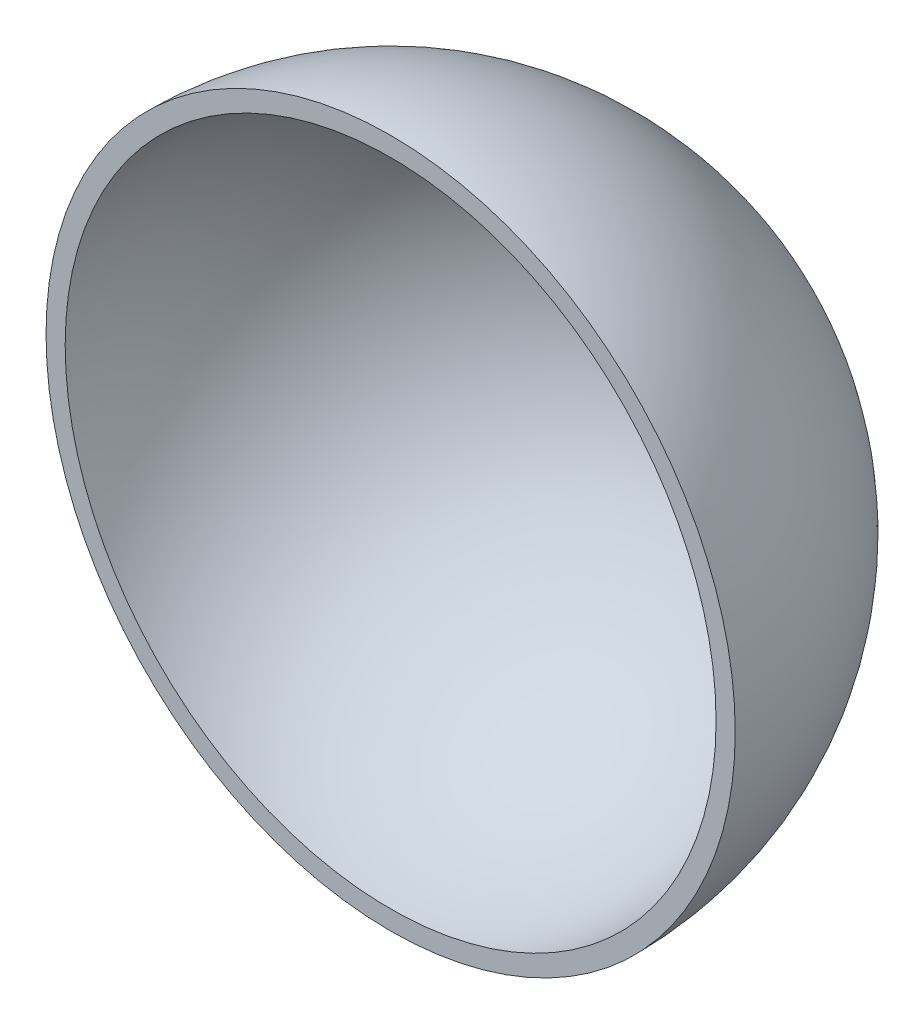
ISO-10303-21;
HEADER;
FILE_DESCRIPTION(('STEP AP214'),'2;1');
FILE_NAME('part.step','',(''),(''),'','','');
FILE_SCHEMA(('AUTOMOTIVE_DESIGN { 1 0 10303 214 1 1 1 1 }'));
ENDSEC;
DATA;
#1=APPLICATION_CONTEXT('core data for automotive mechanical design processes');
#2=APPLICATION_PROTOCOL_DEFINITION('international standard','automotive_design',2000,#1);
#3=PRODUCT_CONTEXT('',#1,'mechanical');
#4=PRODUCT('Part','Part','',(#3));
#5=PRODUCT_RELATED_PRODUCT_CATEGORY('part','',(#4));
#6=PRODUCT_DEFINITION_FORMATION('','',#4);
#7=PRODUCT_DEFINITION_CONTEXT('part definition',#1,'design');
#8=PRODUCT_DEFINITION('design','',#6,#7);
#9=PRODUCT_DEFINITION_SHAPE('','',#8);
#10=(LENGTH_UNIT() NAMED_UNIT(*) SI_UNIT(.MILLI.,.METRE.));
#11=(NAMED_UNIT(*) PLANE_ANGLE_UNIT() SI_UNIT($,.RADIAN.));
#12=(NAMED_UNIT(*) SI_UNIT($,.STERADIAN.) SOLID_ANGLE_UNIT());
#13=UNCERTAINTY_MEASURE_WITH_UNIT(LENGTH_MEASURE(1.E-05),#10,'distance_accuracy_value','');
#14=(GEOMETRIC_REPRESENTATION_CONTEXT(3) GLOBAL_UNCERTAINTY_ASSIGNED_CONTEXT((#13)) GLOBAL_UNIT_ASSIGNED_CONTEXT((#10,
#11,#12)) REPRESENTATION_CONTEXT('',''));
#15=CARTESIAN_POINT('',(0.,0.,0.));
#16=DIRECTION('',(0.,0.,1.));
#17=DIRECTION('',(1.,0.,0.));
#18=AXIS2_PLACEMENT_3D('',#15,#16,#17);
#19=CARTESIAN_POINT('',(0.,90.,0.));
#20=DIRECTION('',(0.,-1.,0.));
#21=DIRECTION('',(1.,0.,0.));
#22=AXIS2_PLACEMENT_3D('',#19,#20,#21);
#23=SPHERICAL_SURFACE('',#22,85.);
#24=CARTESIAN_POINT('',(0.,90.,0.));
#25=DIRECTION('',(0.,0.,1.));
#26=DIRECTION('',(1.,0.,0.));
#27=AXIS2_PLACEMENT_3D('',#24,#25,#26);
#28=SPHERICAL_SURFACE('',#27,85.);
#29=CARTESIAN_POINT('',(0.,90.,-84.9632273398321));
#30=DIRECTION('',(0.,0.,1.));
#31=DIRECTION('',(1.,0.,0.));
#32=AXIS2_PLACEMENT_3D('',#29,#30,#31);
#33=CIRCLE('',#32,2.5);
#34=CARTESIAN_POINT('',(2.5,90.,-84.9632273398321));
#35=VERTEX_POINT('',#34);
#36=EDGE_CURVE('E51',#35,#35,#33,.T.);
#37=ORIENTED_EDGE('',*,*,#36,.F.);
#38=EDGE_LOOP('',(#37));
#39=FACE_BOUND('',#38,.T.);
#40=CARTESIAN_POINT('',(0.,90.,0.));
#41=DIRECTION('',(0.,0.,-1.));
#42=DIRECTION('',(-1.,0.,0.));
#43=AXIS2_PLACEMENT_3D('',#40,#41,#42);
#44=CIRCLE('',#43,85.);
#45=CARTESIAN_POINT('',(-85.,90.,5.93551827603333E-13));
#46=VERTEX_POINT('',#45);
#47=EDGE_CURVE('E46',#46,#46,#44,.F.);
#48=ORIENTED_EDGE('',*,*,#47,.T.);
#49=EDGE_LOOP('',(#48));
#50=FACE_BOUND('',#49,.T.);
#51=ADVANCED_FACE('F39',(#39,#50),#28,.F.);
#52=CARTESIAN_POINT('',(0.,90.,0.));
#53=DIRECTION('',(0.,-1.,0.));
#54=DIRECTION('',(1.,0.,0.));
#55=AXIS2_PLACEMENT_3D('',#52,#53,#54);
#56=SPHERICAL_SURFACE('',#55,90.);
#57=CARTESIAN_POINT('',(0.,90.,0.));
#58=DIRECTION('',(0.,0.,1.));
#59=DIRECTION('',(1.,0.,0.));
#60=AXIS2_PLACEMENT_3D('',#57,#58,#59);
#61=SPHERICAL_SURFACE('',#60,90.);
#62=CARTESIAN_POINT('',(0.,90.,-89.9652710772329));
#63=DIRECTION('',(0.,0.,1.));
#64=DIRECTION('',(1.,0.,0.));
#65=AXIS2_PLACEMENT_3D('',#62,#63,#64);
#66=CIRCLE('',#65,2.5);
#67=CARTESIAN_POINT('',(2.5,90.,-89.9652710772329));
#68=VERTEX_POINT('',#67);
#69=EDGE_CURVE('E56',#68,#68,#66,.F.);
#70=ORIENTED_EDGE('',*,*,#69,.F.);
#71=EDGE_LOOP('',(#70));
#72=FACE_BOUND('',#71,.T.);
#73=CARTESIAN_POINT('',(0.,90.,0.));
#74=DIRECTION('',(0.,0.,-1.));
#75=DIRECTION('',(-1.,0.,0.));
#76=AXIS2_PLACEMENT_3D('',#73,#74,#75);
#77=CIRCLE('',#76,90.);
#78=CARTESIAN_POINT('',(-90.,90.,6.28466640991764E-13));
#79=VERTEX_POINT('',#78);
#80=EDGE_CURVE('E10',#79,#79,#77,.F.);
#81=ORIENTED_EDGE('',*,*,#80,.F.);
#82=EDGE_LOOP('',(#81));
#83=FACE_BOUND('',#82,.T.);
#84=ADVANCED_FACE('F65',(#72,#83),#61,.T.);
#85=CARTESIAN_POINT('',(0.,0.,0.));
#86=DIRECTION('',(0.,0.,-1.));
#87=DIRECTION('',(-1.,0.,0.));
#88=AXIS2_PLACEMENT_3D('',#85,#86,#87);
#89=PLANE('',#88);
#90=ORIENTED_EDGE('',*,*,#80,.T.);
#91=EDGE_LOOP('',(#90));
#92=FACE_BOUND('',#91,.T.);
#93=ORIENTED_EDGE('',*,*,#47,.F.);
#94=EDGE_LOOP('',(#93));
#95=FACE_BOUND('',#94,.T.);
#96=ADVANCED_FACE('F68',(#92,#95),#89,.F.);
#97=CARTESIAN_POINT('',(0.,90.,-90.001));
#98=DIRECTION('',(0.,0.,1.));
#99=DIRECTION('',(1.,0.,0.));
#100=AXIS2_PLACEMENT_3D('',#97,#98,#99);
#101=CYLINDRICAL_SURFACE('',#100,2.5);
#102=CARTESIAN_POINT('',(2.5,90.,-84.9632273398321));
#103=CARTESIAN_POINT('',(2.5,90.,-85.0153319620968));
#104=CARTESIAN_POINT('',(2.5,90.,-85.0674365843613));
#105=CARTESIAN_POINT('',(2.5,90.,-85.1716458288905));
#106=CARTESIAN_POINT('',(2.5,90.,-85.2237504511551));
#107=CARTESIAN_POINT('',(2.5,90.,-85.3279596956843));
#108=CARTESIAN_POINT('',(2.5,90.,-85.3800643179489));
#109=CARTESIAN_POINT('',(2.5,90.,-85.4842735624781));
#110=CARTESIAN_POINT('',(2.5,90.,-85.5363781847427));
#111=CARTESIAN_POINT('',(2.5,90.,-85.6405874292718));
#112=CARTESIAN_POINT('',(2.5,90.,-85.6926920515364));
#113=CARTESIAN_POINT('',(2.5,90.,-85.7969012960656));
#114=CARTESIAN_POINT('',(2.5,90.,-85.8490059183302));
#115=CARTESIAN_POINT('',(2.5,90.,-85.9532151628594));
#116=CARTESIAN_POINT('',(2.5,90.,-86.005319785124));
#117=CARTESIAN_POINT('',(2.5,90.,-86.1095290296532));
#118=CARTESIAN_POINT('',(2.5,90.,-86.1616336519178));
#119=CARTESIAN_POINT('',(2.5,90.,-86.2658428964469));
#120=CARTESIAN_POINT('',(2.5,90.,-86.3179475187115));
#121=CARTESIAN_POINT('',(2.5,90.,-86.4221567632407));
#122=CARTESIAN_POINT('',(2.5,90.,-86.4742613855053));
#123=CARTESIAN_POINT('',(2.5,90.,-86.5784706300345));
#124=CARTESIAN_POINT('',(2.5,90.,-86.6305752522991));
#125=CARTESIAN_POINT('',(2.5,90.,-86.7347844968283));
#126=CARTESIAN_POINT('',(2.5,90.,-86.7868891190928));
#127=CARTESIAN_POINT('',(2.5,90.,-86.891098363622));
#128=CARTESIAN_POINT('',(2.5,90.,-86.9432029858866));
#129=CARTESIAN_POINT('',(2.5,90.,-87.0474122304158));
#130=CARTESIAN_POINT('',(2.5,90.,-87.0995168526804));
#131=CARTESIAN_POINT('',(2.5,90.,-87.2037260972096));
#132=CARTESIAN_POINT('',(2.5,90.,-87.2558307194742));
#133=CARTESIAN_POINT('',(2.5,90.,-87.3600399640034));
#134=CARTESIAN_POINT('',(2.5,90.,-87.4121445862679));
#135=CARTESIAN_POINT('',(2.5,90.,-87.5163538307971));
#136=CARTESIAN_POINT('',(2.5,90.,-87.5684584530617));
#137=CARTESIAN_POINT('',(2.5,90.,-87.6726676975909));
#138=CARTESIAN_POINT('',(2.5,90.,-87.7247723198555));
#139=CARTESIAN_POINT('',(2.5,90.,-87.8289815643847));
#140=CARTESIAN_POINT('',(2.5,90.,-87.8810861866493));
#141=CARTESIAN_POINT('',(2.5,90.,-87.9852954311785));
#142=CARTESIAN_POINT('',(2.5,90.,-88.0374000534431));
#143=CARTESIAN_POINT('',(2.5,90.,-88.1416092979722));
#144=CARTESIAN_POINT('',(2.5,90.,-88.1937139202368));
#145=CARTESIAN_POINT('',(2.5,90.,-88.297923164766));
#146=CARTESIAN_POINT('',(2.5,90.,-88.3500277870306));
#147=CARTESIAN_POINT('',(2.5,90.,-88.4542370315598));
#148=CARTESIAN_POINT('',(2.5,90.,-88.5063416538244));
#149=CARTESIAN_POINT('',(2.5,90.,-88.6105508983536));
#150=CARTESIAN_POINT('',(2.5,90.,-88.6626555206182));
#151=CARTESIAN_POINT('',(2.5,90.,-88.7668647651473));
#152=CARTESIAN_POINT('',(2.5,90.,-88.8189693874119));
#153=CARTESIAN_POINT('',(2.5,90.,-88.9231786319411));
#154=CARTESIAN_POINT('',(2.5,90.,-88.9752832542057));
#155=CARTESIAN_POINT('',(2.5,90.,-89.0794924987349));
#156=CARTESIAN_POINT('',(2.5,90.,-89.1315971209995));
#157=CARTESIAN_POINT('',(2.5,90.,-89.2358063655286));
#158=CARTESIAN_POINT('',(2.5,90.,-89.2879109877933));
#159=CARTESIAN_POINT('',(2.5,90.,-89.3921202323224));
#160=CARTESIAN_POINT('',(2.5,90.,-89.444224854587));
#161=CARTESIAN_POINT('',(2.5,90.,-89.5484340991162));
#162=CARTESIAN_POINT('',(2.5,90.,-89.6005387213808));
#163=CARTESIAN_POINT('',(2.5,90.,-89.70474796591));
#164=CARTESIAN_POINT('',(2.5,90.,-89.7568525881746));
#165=CARTESIAN_POINT('',(2.5,90.,-89.8610618327038));
#166=CARTESIAN_POINT('',(2.5,90.,-89.9131664549683));
#167=CARTESIAN_POINT('',(2.5,90.,-89.9652710772329));
#168=B_SPLINE_CURVE_WITH_KNOTS('',3,(#102,#103,#104,#105,#106,#107,#108,#109,#110,#111,#112,
#113,#114,#115,#116,#117,#118,#119,#120,#121,#122,#123,#124,#125,#126,#127,#128,#129,#130,#131,
#132,#133,#134,#135,#136,#137,#138,#139,#140,#141,#142,#143,#144,#145,#146,#147,#148,#149,#150,
#151,#152,#153,#154,#155,#156,#157,#158,#159,#160,#161,#162,#163,#164,#165,#166,#167),
.UNSPECIFIED.,.F.,.F.,(4,2,2,2,2,2,2,2,2,2,2,2,2,2,2,2,2,2,2,2,2,2,2,2,2,2,2,2,2,2,2,2,4),(0.,
0.156313866793781,0.312627733587548,0.468941600381328,0.625255467175109,0.781569333968876,
0.937883200762657,1.09419706755642,1.2505109343502,1.40682480114397,1.56313866793775,
1.71945253473152,1.8757664015253,2.03208026831907,2.18839413511285,2.34470800190661,
2.5010218687004,2.65733573549416,2.81364960228794,2.96996346908172,3.12627733587549,
3.28259120266927,3.43890506946304,3.59521893625682,3.75153280305059,3.90784666984437,
4.06416053663813,4.22047440343191,4.37678827022568,4.53310213701946,4.68941600381323,
4.84572987060701,5.00204373740079),.UNSPECIFIED.);
#169=EDGE_CURVE('BSEAM63',#35,#68,#168,.T.);
#170=ORIENTED_EDGE('',*,*,#36,.T.);
#171=ORIENTED_EDGE('',*,*,#69,.T.);
#172=ORIENTED_EDGE('',*,*,#169,.T.);
#173=ORIENTED_EDGE('',*,*,#169,.F.);
#174=EDGE_LOOP('',(#170,#172,#171,#173));
#175=FACE_BOUND('',#174,.T.);
#176=ADVANCED_FACE('F63',(#175),#101,.F.);
#177=CLOSED_SHELL('',(#51,#84,#96,#176));
#178=MANIFOLD_SOLID_BREP('B2',#177);
#179=ADVANCED_BREP_SHAPE_REPRESENTATION('',(#18,#178),#14);
#180=SHAPE_DEFINITION_REPRESENTATION(#9,#179);
ENDSEC;
END-ISO-10303-21;
